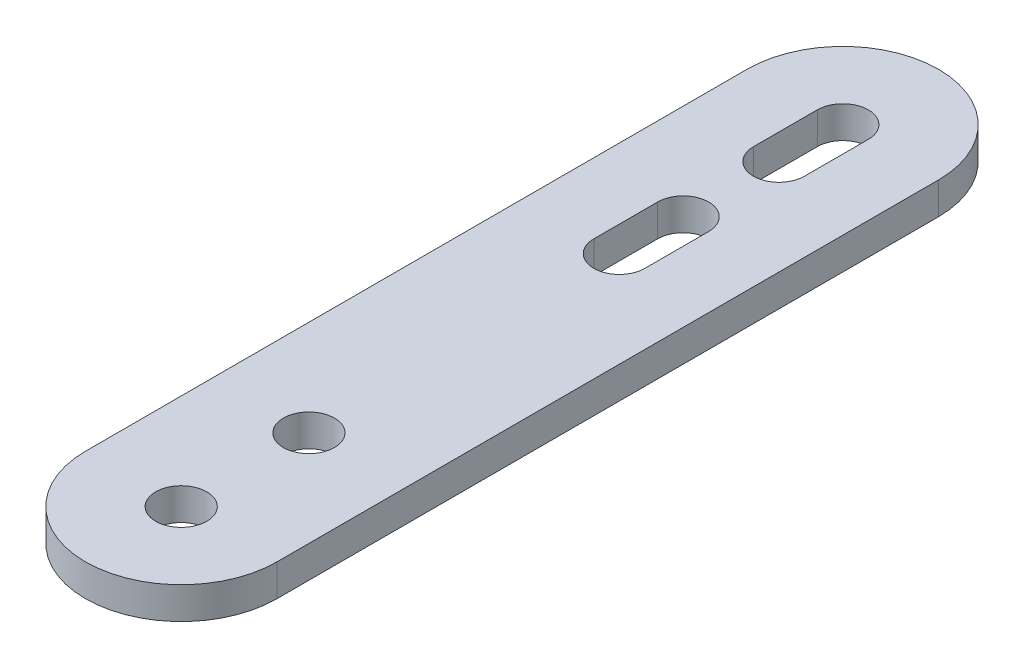
ISO-10303-21;
HEADER;
FILE_DESCRIPTION(('STEP AP214'),'2;1');
FILE_NAME('part.step','',(''),(''),'','','');
FILE_SCHEMA(('AUTOMOTIVE_DESIGN { 1 0 10303 214 1 1 1 1 }'));
ENDSEC;
DATA;
#1=APPLICATION_CONTEXT('core data for automotive mechanical design processes');
#2=APPLICATION_PROTOCOL_DEFINITION('international standard','automotive_design',2000,#1);
#3=PRODUCT_CONTEXT('',#1,'mechanical');
#4=PRODUCT('Part','Part','',(#3));
#5=PRODUCT_RELATED_PRODUCT_CATEGORY('part','',(#4));
#6=PRODUCT_DEFINITION_FORMATION('','',#4);
#7=PRODUCT_DEFINITION_CONTEXT('part definition',#1,'design');
#8=PRODUCT_DEFINITION('design','',#6,#7);
#9=PRODUCT_DEFINITION_SHAPE('','',#8);
#10=(LENGTH_UNIT() NAMED_UNIT(*) SI_UNIT(.MILLI.,.METRE.));
#11=(NAMED_UNIT(*) PLANE_ANGLE_UNIT() SI_UNIT($,.RADIAN.));
#12=(NAMED_UNIT(*) SI_UNIT($,.STERADIAN.) SOLID_ANGLE_UNIT());
#13=UNCERTAINTY_MEASURE_WITH_UNIT(LENGTH_MEASURE(1.E-05),#10,'distance_accuracy_value','');
#14=(GEOMETRIC_REPRESENTATION_CONTEXT(3) GLOBAL_UNCERTAINTY_ASSIGNED_CONTEXT((#13)) GLOBAL_UNIT_ASSIGNED_CONTEXT((#10,
#11,#12)) REPRESENTATION_CONTEXT('',''));
#15=CARTESIAN_POINT('',(0.,0.,0.));
#16=DIRECTION('',(0.,0.,1.));
#17=DIRECTION('',(1.,0.,0.));
#18=AXIS2_PLACEMENT_3D('',#15,#16,#17);
#19=CARTESIAN_POINT('',(0.,0.,-38.6108393913044));
#20=DIRECTION('',(0.,1.,0.));
#21=DIRECTION('',(1.,0.,0.));
#22=AXIS2_PLACEMENT_3D('',#19,#20,#21);
#23=CYLINDRICAL_SURFACE('',#22,4.00000000000002);
#24=CARTESIAN_POINT('',(0.,5.00000000000002,-38.6108393913044));
#25=DIRECTION('',(0.,1.,0.));
#26=DIRECTION('',(1.,0.,0.));
#27=AXIS2_PLACEMENT_3D('',#24,#25,#26);
#28=CIRCLE('',#27,4.00000000000002);
#29=CARTESIAN_POINT('',(-4.00000000000001,5.00000000000002,-38.6108393913044));
#30=VERTEX_POINT('',#29);
#31=CARTESIAN_POINT('',(4.00000000000002,5.00000000000002,-38.6108393913044));
#32=VERTEX_POINT('',#31);
#33=EDGE_CURVE('E181',#30,#32,#28,.T.);
#34=ORIENTED_EDGE('',*,*,#33,.T.);
#35=DIRECTION('',(0.,1.,0.));
#36=VECTOR('',#35,1.);
#37=CARTESIAN_POINT('',(4.00000000000002,0.,-38.6108393913044));
#38=LINE('',#37,#36);
#39=CARTESIAN_POINT('',(4.00000000000002,0.,-38.6108393913044));
#40=VERTEX_POINT('',#39);
#41=EDGE_CURVE('E228',#40,#32,#38,.T.);
#42=ORIENTED_EDGE('',*,*,#41,.F.);
#43=CARTESIAN_POINT('',(0.,0.,-38.6108393913044));
#44=DIRECTION('',(0.,1.,0.));
#45=DIRECTION('',(1.,0.,0.));
#46=AXIS2_PLACEMENT_3D('',#43,#44,#45);
#47=CIRCLE('',#46,4.00000000000002);
#48=CARTESIAN_POINT('',(-4.00000000000001,0.,-38.6108393913044));
#49=VERTEX_POINT('',#48);
#50=EDGE_CURVE('E140',#49,#40,#47,.T.);
#51=ORIENTED_EDGE('',*,*,#50,.F.);
#52=DIRECTION('',(0.,1.,0.));
#53=VECTOR('',#52,1.);
#54=CARTESIAN_POINT('',(-4.00000000000001,0.,-38.6108393913044));
#55=LINE('',#54,#53);
#56=EDGE_CURVE('E234',#49,#30,#55,.T.);
#57=ORIENTED_EDGE('',*,*,#56,.T.);
#58=EDGE_LOOP('',(#34,#42,#51,#57));
#59=FACE_BOUND('',#58,.T.);
#60=ADVANCED_FACE('F45',(#59),#23,.F.);
#61=CARTESIAN_POINT('',(-4.00000000000001,0.,-48.6108393913044));
#62=DIRECTION('',(-1.,0.,0.));
#63=DIRECTION('',(0.,0.,1.));
#64=AXIS2_PLACEMENT_3D('',#61,#62,#63);
#65=PLANE('',#64);
#66=DIRECTION('',(0.,0.,1.));
#67=VECTOR('',#66,1.);
#68=CARTESIAN_POINT('',(-4.00000000000001,5.00000000000002,-48.6108393913044));
#69=LINE('',#68,#67);
#70=CARTESIAN_POINT('',(-4.00000000000001,5.00000000000002,-48.6108393913044));
#71=VERTEX_POINT('',#70);
#72=EDGE_CURVE('E184',#71,#30,#69,.T.);
#73=ORIENTED_EDGE('',*,*,#72,.T.);
#74=ORIENTED_EDGE('',*,*,#56,.F.);
#75=DIRECTION('',(0.,0.,1.));
#76=VECTOR('',#75,1.);
#77=CARTESIAN_POINT('',(-4.00000000000001,0.,-48.6108393913044));
#78=LINE('',#77,#76);
#79=CARTESIAN_POINT('',(-4.00000000000001,0.,-48.6108393913044));
#80=VERTEX_POINT('',#79);
#81=EDGE_CURVE('E219',#80,#49,#78,.T.);
#82=ORIENTED_EDGE('',*,*,#81,.F.);
#83=DIRECTION('',(0.,1.,0.));
#84=VECTOR('',#83,1.);
#85=CARTESIAN_POINT('',(-4.00000000000001,0.,-48.6108393913044));
#86=LINE('',#85,#84);
#87=EDGE_CURVE('E231',#80,#71,#86,.T.);
#88=ORIENTED_EDGE('',*,*,#87,.T.);
#89=EDGE_LOOP('',(#73,#74,#82,#88));
#90=FACE_BOUND('',#89,.T.);
#91=ADVANCED_FACE('F242',(#90),#65,.F.);
#92=CARTESIAN_POINT('',(0.,0.,-48.6108393913044));
#93=DIRECTION('',(0.,1.,0.));
#94=DIRECTION('',(1.,0.,0.));
#95=AXIS2_PLACEMENT_3D('',#92,#93,#94);
#96=CYLINDRICAL_SURFACE('',#95,4.00000000000002);
#97=CARTESIAN_POINT('',(0.,5.00000000000002,-48.6108393913044));
#98=DIRECTION('',(0.,1.,0.));
#99=DIRECTION('',(1.,0.,0.));
#100=AXIS2_PLACEMENT_3D('',#97,#98,#99);
#101=CIRCLE('',#100,4.00000000000002);
#102=CARTESIAN_POINT('',(4.00000000000002,5.00000000000002,-48.6108393913044));
#103=VERTEX_POINT('',#102);
#104=EDGE_CURVE('E176',#103,#71,#101,.T.);
#105=ORIENTED_EDGE('',*,*,#104,.T.);
#106=ORIENTED_EDGE('',*,*,#87,.F.);
#107=CARTESIAN_POINT('',(0.,0.,-48.6108393913044));
#108=DIRECTION('',(0.,1.,0.));
#109=DIRECTION('',(1.,0.,0.));
#110=AXIS2_PLACEMENT_3D('',#107,#108,#109);
#111=CIRCLE('',#110,4.00000000000002);
#112=CARTESIAN_POINT('',(4.00000000000002,0.,-48.6108393913044));
#113=VERTEX_POINT('',#112);
#114=EDGE_CURVE('E217',#113,#80,#111,.T.);
#115=ORIENTED_EDGE('',*,*,#114,.F.);
#116=DIRECTION('',(0.,1.,0.));
#117=VECTOR('',#116,1.);
#118=CARTESIAN_POINT('',(4.00000000000002,0.,-48.6108393913044));
#119=LINE('',#118,#117);
#120=EDGE_CURVE('E225',#113,#103,#119,.T.);
#121=ORIENTED_EDGE('',*,*,#120,.T.);
#122=EDGE_LOOP('',(#105,#106,#115,#121));
#123=FACE_BOUND('',#122,.T.);
#124=ADVANCED_FACE('F252',(#123),#96,.F.);
#125=CARTESIAN_POINT('',(4.00000000000002,0.,-48.6108393913044));
#126=DIRECTION('',(1.,0.,0.));
#127=DIRECTION('',(0.,0.,-1.));
#128=AXIS2_PLACEMENT_3D('',#125,#126,#127);
#129=PLANE('',#128);
#130=DIRECTION('',(0.,0.,-1.));
#131=VECTOR('',#130,1.);
#132=CARTESIAN_POINT('',(4.00000000000002,5.00000000000002,-48.6108393913044));
#133=LINE('',#132,#131);
#134=EDGE_CURVE('E178',#32,#103,#133,.T.);
#135=ORIENTED_EDGE('',*,*,#134,.T.);
#136=ORIENTED_EDGE('',*,*,#120,.F.);
#137=DIRECTION('',(0.,0.,-1.));
#138=VECTOR('',#137,1.);
#139=CARTESIAN_POINT('',(4.00000000000002,0.,-48.6108393913044));
#140=LINE('',#139,#138);
#141=EDGE_CURVE('E215',#40,#113,#140,.T.);
#142=ORIENTED_EDGE('',*,*,#141,.F.);
#143=ORIENTED_EDGE('',*,*,#41,.T.);
#144=EDGE_LOOP('',(#135,#136,#142,#143));
#145=FACE_BOUND('',#144,.T.);
#146=ADVANCED_FACE('F249',(#145),#129,.F.);
#147=CARTESIAN_POINT('',(-15.,0.,-63.6108393913044));
#148=DIRECTION('',(0.,1.,0.));
#149=DIRECTION('',(1.,0.,0.));
#150=AXIS2_PLACEMENT_3D('',#147,#148,#149);
#151=PLANE('',#150);
#152=DIRECTION('',(0.,0.,1.));
#153=VECTOR('',#152,1.);
#154=CARTESIAN_POINT('',(-4.,0.,-13.6108393913044));
#155=LINE('',#154,#153);
#156=CARTESIAN_POINT('',(-4.,0.,-23.6108393913044));
#157=VERTEX_POINT('',#156);
#158=CARTESIAN_POINT('',(-4.,0.,-13.6108393913044));
#159=VERTEX_POINT('',#158);
#160=EDGE_CURVE('E212',#157,#159,#155,.T.);
#161=ORIENTED_EDGE('',*,*,#160,.T.);
#162=CARTESIAN_POINT('',(0.,0.,-13.6108393913044));
#163=DIRECTION('',(0.,1.,0.));
#164=DIRECTION('',(1.,0.,0.));
#165=AXIS2_PLACEMENT_3D('',#162,#163,#164);
#166=CIRCLE('',#165,4.);
#167=CARTESIAN_POINT('',(4.00000000000001,0.,-13.6108393913044));
#168=VERTEX_POINT('',#167);
#169=EDGE_CURVE('E194',#159,#168,#166,.T.);
#170=ORIENTED_EDGE('',*,*,#169,.T.);
#171=DIRECTION('',(0.,0.,-1.));
#172=VECTOR('',#171,1.);
#173=CARTESIAN_POINT('',(4.00000000000001,0.,-13.6108393913044));
#174=LINE('',#173,#172);
#175=CARTESIAN_POINT('',(4.00000000000001,0.,-23.6108393913044));
#176=VERTEX_POINT('',#175);
#177=EDGE_CURVE('E203',#168,#176,#174,.T.);
#178=ORIENTED_EDGE('',*,*,#177,.T.);
#179=CARTESIAN_POINT('',(0.,0.,-23.6108393913044));
#180=DIRECTION('',(0.,1.,0.));
#181=DIRECTION('',(1.,0.,0.));
#182=AXIS2_PLACEMENT_3D('',#179,#180,#181);
#183=CIRCLE('',#182,4.);
#184=EDGE_CURVE('E209',#176,#157,#183,.T.);
#185=ORIENTED_EDGE('',*,*,#184,.T.);
#186=EDGE_LOOP('',(#161,#170,#178,#185));
#187=FACE_BOUND('',#186,.T.);
#188=ORIENTED_EDGE('',*,*,#141,.T.);
#189=ORIENTED_EDGE('',*,*,#114,.T.);
#190=ORIENTED_EDGE('',*,*,#81,.T.);
#191=ORIENTED_EDGE('',*,*,#50,.T.);
#192=EDGE_LOOP('',(#188,#189,#190,#191));
#193=FACE_BOUND('',#192,.T.);
#194=DIRECTION('',(0.,0.,1.));
#195=VECTOR('',#194,1.);
#196=CARTESIAN_POINT('',(15.,0.,-63.6108393913044));
#197=LINE('',#196,#195);
#198=CARTESIAN_POINT('',(15.,0.,-48.6108393913044));
#199=VERTEX_POINT('',#198);
#200=CARTESIAN_POINT('',(15.,0.,55.));
#201=VERTEX_POINT('',#200);
#202=EDGE_CURVE('E147',#199,#201,#197,.T.);
#203=ORIENTED_EDGE('',*,*,#202,.T.);
#204=CARTESIAN_POINT('',(0.,0.,55.));
#205=DIRECTION('',(0.,1.,0.));
#206=DIRECTION('',(0.,0.,1.));
#207=AXIS2_PLACEMENT_3D('',#204,#205,#206);
#208=CIRCLE('',#207,15.);
#209=CARTESIAN_POINT('',(-15.,0.,55.));
#210=VERTEX_POINT('',#209);
#211=EDGE_CURVE('E143',#201,#210,#208,.F.);
#212=ORIENTED_EDGE('',*,*,#211,.T.);
#213=DIRECTION('',(0.,0.,1.));
#214=VECTOR('',#213,1.);
#215=CARTESIAN_POINT('',(-15.,0.,-63.6108393913044));
#216=LINE('',#215,#214);
#217=CARTESIAN_POINT('',(-15.,0.,-48.6108393913044));
#218=VERTEX_POINT('',#217);
#219=EDGE_CURVE('E132',#218,#210,#216,.T.);
#220=ORIENTED_EDGE('',*,*,#219,.F.);
#221=CARTESIAN_POINT('',(0.,0.,-48.6108393913044));
#222=DIRECTION('',(0.,1.,0.));
#223=DIRECTION('',(1.,0.,0.));
#224=AXIS2_PLACEMENT_3D('',#221,#222,#223);
#225=CIRCLE('',#224,15.);
#226=EDGE_CURVE('E139',#218,#199,#225,.F.);
#227=ORIENTED_EDGE('',*,*,#226,.T.);
#228=EDGE_LOOP('',(#203,#212,#220,#227));
#229=FACE_BOUND('',#228,.T.);
#230=CARTESIAN_POINT('',(0.,0.,55.));
#231=DIRECTION('',(0.,1.,0.));
#232=DIRECTION('',(0.,0.,1.));
#233=AXIS2_PLACEMENT_3D('',#230,#231,#232);
#234=CIRCLE('',#233,4.);
#235=CARTESIAN_POINT('',(0.,0.,59.));
#236=VERTEX_POINT('',#235);
#237=EDGE_CURVE('E292',#236,#236,#234,.T.);
#238=ORIENTED_EDGE('',*,*,#237,.T.);
#239=EDGE_LOOP('',(#238));
#240=FACE_BOUND('',#239,.T.);
#241=CARTESIAN_POINT('',(0.,0.,35.));
#242=DIRECTION('',(0.,1.,0.));
#243=DIRECTION('',(0.,0.,1.));
#244=AXIS2_PLACEMENT_3D('',#241,#242,#243);
#245=CIRCLE('',#244,4.);
#246=CARTESIAN_POINT('',(0.,0.,39.));
#247=VERTEX_POINT('',#246);
#248=EDGE_CURVE('E152',#247,#247,#245,.T.);
#249=ORIENTED_EDGE('',*,*,#248,.T.);
#250=EDGE_LOOP('',(#249));
#251=FACE_BOUND('',#250,.T.);
#252=ADVANCED_FACE('F144',(#187,#193,#229,#240,#251),#151,.F.);
#253=CARTESIAN_POINT('',(-4.,0.,-13.6108393913044));
#254=DIRECTION('',(-1.,0.,0.));
#255=DIRECTION('',(0.,0.,1.));
#256=AXIS2_PLACEMENT_3D('',#253,#254,#255);
#257=PLANE('',#256);
#258=DIRECTION('',(0.,0.,1.));
#259=VECTOR('',#258,1.);
#260=CARTESIAN_POINT('',(-4.,5.00000000000001,-13.6108393913044));
#261=LINE('',#260,#259);
#262=CARTESIAN_POINT('',(-4.,5.00000000000001,-23.6108393913044));
#263=VERTEX_POINT('',#262);
#264=CARTESIAN_POINT('',(-4.,5.00000000000001,-13.6108393913044));
#265=VERTEX_POINT('',#264);
#266=EDGE_CURVE('E167',#263,#265,#261,.T.);
#267=ORIENTED_EDGE('',*,*,#266,.T.);
#268=DIRECTION('',(0.,1.,0.));
#269=VECTOR('',#268,1.);
#270=CARTESIAN_POINT('',(-4.,0.,-13.6108393913044));
#271=LINE('',#270,#269);
#272=EDGE_CURVE('E197',#159,#265,#271,.T.);
#273=ORIENTED_EDGE('',*,*,#272,.F.);
#274=ORIENTED_EDGE('',*,*,#160,.F.);
#275=DIRECTION('',(0.,1.,0.));
#276=VECTOR('',#275,1.);
#277=CARTESIAN_POINT('',(-4.,0.,-23.6108393913044));
#278=LINE('',#277,#276);
#279=EDGE_CURVE('E206',#157,#263,#278,.T.);
#280=ORIENTED_EDGE('',*,*,#279,.T.);
#281=EDGE_LOOP('',(#267,#273,#274,#280));
#282=FACE_BOUND('',#281,.T.);
#283=ADVANCED_FACE('F255',(#282),#257,.F.);
#284=CARTESIAN_POINT('',(0.,0.,-23.6108393913044));
#285=DIRECTION('',(0.,1.,0.));
#286=DIRECTION('',(1.,0.,0.));
#287=AXIS2_PLACEMENT_3D('',#284,#285,#286);
#288=CYLINDRICAL_SURFACE('',#287,4.);
#289=CARTESIAN_POINT('',(0.,5.00000000000001,-23.6108393913044));
#290=DIRECTION('',(0.,1.,0.));
#291=DIRECTION('',(1.,0.,0.));
#292=AXIS2_PLACEMENT_3D('',#289,#290,#291);
#293=CIRCLE('',#292,4.);
#294=CARTESIAN_POINT('',(4.,5.00000000000001,-23.6108393913044));
#295=VERTEX_POINT('',#294);
#296=EDGE_CURVE('E170',#295,#263,#293,.T.);
#297=ORIENTED_EDGE('',*,*,#296,.T.);
#298=ORIENTED_EDGE('',*,*,#279,.F.);
#299=ORIENTED_EDGE('',*,*,#184,.F.);
#300=DIRECTION('',(0.,1.,0.));
#301=VECTOR('',#300,1.);
#302=CARTESIAN_POINT('',(4.,0.,-23.6108393913044));
#303=LINE('',#302,#301);
#304=EDGE_CURVE('E200',#176,#295,#303,.T.);
#305=ORIENTED_EDGE('',*,*,#304,.T.);
#306=EDGE_LOOP('',(#297,#298,#299,#305));
#307=FACE_BOUND('',#306,.T.);
#308=ADVANCED_FACE('F262',(#307),#288,.F.);
#309=CARTESIAN_POINT('',(4.00000000000001,0.,-13.6108393913044));
#310=DIRECTION('',(1.,0.,0.));
#311=DIRECTION('',(0.,0.,-1.));
#312=AXIS2_PLACEMENT_3D('',#309,#310,#311);
#313=PLANE('',#312);
#314=DIRECTION('',(0.,0.,-1.));
#315=VECTOR('',#314,1.);
#316=CARTESIAN_POINT('',(4.00000000000001,5.00000000000001,-13.6108393913044));
#317=LINE('',#316,#315);
#318=CARTESIAN_POINT('',(4.00000000000001,5.00000000000001,-13.6108393913044));
#319=VERTEX_POINT('',#318);
#320=EDGE_CURVE('E173',#319,#295,#317,.T.);
#321=ORIENTED_EDGE('',*,*,#320,.T.);
#322=ORIENTED_EDGE('',*,*,#304,.F.);
#323=ORIENTED_EDGE('',*,*,#177,.F.);
#324=DIRECTION('',(0.,1.,0.));
#325=VECTOR('',#324,1.);
#326=CARTESIAN_POINT('',(4.00000000000001,0.,-13.6108393913044));
#327=LINE('',#326,#325);
#328=EDGE_CURVE('E191',#168,#319,#327,.T.);
#329=ORIENTED_EDGE('',*,*,#328,.T.);
#330=EDGE_LOOP('',(#321,#322,#323,#329));
#331=FACE_BOUND('',#330,.T.);
#332=ADVANCED_FACE('F317',(#331),#313,.F.);
#333=CARTESIAN_POINT('',(0.,0.,-13.6108393913044));
#334=DIRECTION('',(0.,1.,0.));
#335=DIRECTION('',(1.,0.,0.));
#336=AXIS2_PLACEMENT_3D('',#333,#334,#335);
#337=CYLINDRICAL_SURFACE('',#336,4.);
#338=CARTESIAN_POINT('',(0.,5.00000000000001,-13.6108393913044));
#339=DIRECTION('',(0.,1.,0.));
#340=DIRECTION('',(1.,0.,0.));
#341=AXIS2_PLACEMENT_3D('',#338,#339,#340);
#342=CIRCLE('',#341,4.);
#343=EDGE_CURVE('E165',#265,#319,#342,.T.);
#344=ORIENTED_EDGE('',*,*,#343,.T.);
#345=ORIENTED_EDGE('',*,*,#328,.F.);
#346=ORIENTED_EDGE('',*,*,#169,.F.);
#347=ORIENTED_EDGE('',*,*,#272,.T.);
#348=EDGE_LOOP('',(#344,#345,#346,#347));
#349=FACE_BOUND('',#348,.T.);
#350=ADVANCED_FACE('F284',(#349),#337,.F.);
#351=CARTESIAN_POINT('',(-15.,5.00000000000001,0.));
#352=DIRECTION('',(0.,1.,0.));
#353=DIRECTION('',(0.,0.,1.));
#354=AXIS2_PLACEMENT_3D('',#351,#352,#353);
#355=PLANE('',#354);
#356=DIRECTION('',(0.,0.,-1.));
#357=VECTOR('',#356,1.);
#358=CARTESIAN_POINT('',(-15.,5.00000000000002,-63.6108393913044));
#359=LINE('',#358,#357);
#360=CARTESIAN_POINT('',(-15.,5.00000000000003,-48.6108393913044));
#361=VERTEX_POINT('',#360);
#362=CARTESIAN_POINT('',(-15.,5.,55.));
#363=VERTEX_POINT('',#362);
#364=EDGE_CURVE('E67',#361,#363,#359,.F.);
#365=ORIENTED_EDGE('',*,*,#364,.T.);
#366=CARTESIAN_POINT('',(0.,5.,55.));
#367=DIRECTION('',(0.,1.,0.));
#368=DIRECTION('',(0.,0.,1.));
#369=AXIS2_PLACEMENT_3D('',#366,#367,#368);
#370=CIRCLE('',#369,15.);
#371=CARTESIAN_POINT('',(15.,5.,55.));
#372=VERTEX_POINT('',#371);
#373=EDGE_CURVE('E157',#363,#372,#370,.T.);
#374=ORIENTED_EDGE('',*,*,#373,.T.);
#375=DIRECTION('',(0.,0.,-1.));
#376=VECTOR('',#375,1.);
#377=CARTESIAN_POINT('',(15.,5.00000000000002,-63.6108393913044));
#378=LINE('',#377,#376);
#379=CARTESIAN_POINT('',(15.,5.00000000000003,-48.6108393913044));
#380=VERTEX_POINT('',#379);
#381=EDGE_CURVE('E187',#380,#372,#378,.F.);
#382=ORIENTED_EDGE('',*,*,#381,.F.);
#383=CARTESIAN_POINT('',(0.,5.00000000000002,-48.6108393913044));
#384=DIRECTION('',(0.,1.,0.));
#385=DIRECTION('',(1.,0.,0.));
#386=AXIS2_PLACEMENT_3D('',#383,#384,#385);
#387=CIRCLE('',#386,15.);
#388=EDGE_CURVE('E59',#380,#361,#387,.T.);
#389=ORIENTED_EDGE('',*,*,#388,.T.);
#390=EDGE_LOOP('',(#365,#374,#382,#389));
#391=FACE_BOUND('',#390,.T.);
#392=ORIENTED_EDGE('',*,*,#343,.F.);
#393=ORIENTED_EDGE('',*,*,#266,.F.);
#394=ORIENTED_EDGE('',*,*,#296,.F.);
#395=ORIENTED_EDGE('',*,*,#320,.F.);
#396=EDGE_LOOP('',(#392,#393,#394,#395));
#397=FACE_BOUND('',#396,.T.);
#398=ORIENTED_EDGE('',*,*,#104,.F.);
#399=ORIENTED_EDGE('',*,*,#134,.F.);
#400=ORIENTED_EDGE('',*,*,#33,.F.);
#401=ORIENTED_EDGE('',*,*,#72,.F.);
#402=EDGE_LOOP('',(#398,#399,#400,#401));
#403=FACE_BOUND('',#402,.T.);
#404=CARTESIAN_POINT('',(0.,5.,35.));
#405=DIRECTION('',(0.,1.,0.));
#406=DIRECTION('',(0.,0.,1.));
#407=AXIS2_PLACEMENT_3D('',#404,#405,#406);
#408=CIRCLE('',#407,4.);
#409=CARTESIAN_POINT('',(0.,5.,39.));
#410=VERTEX_POINT('',#409);
#411=EDGE_CURVE('E161',#410,#410,#408,.T.);
#412=ORIENTED_EDGE('',*,*,#411,.F.);
#413=EDGE_LOOP('',(#412));
#414=FACE_BOUND('',#413,.T.);
#415=CARTESIAN_POINT('',(0.,5.,55.));
#416=DIRECTION('',(0.,1.,0.));
#417=DIRECTION('',(0.,0.,1.));
#418=AXIS2_PLACEMENT_3D('',#415,#416,#417);
#419=CIRCLE('',#418,4.);
#420=CARTESIAN_POINT('',(0.,5.,59.));
#421=VERTEX_POINT('',#420);
#422=EDGE_CURVE('E158',#421,#421,#419,.T.);
#423=ORIENTED_EDGE('',*,*,#422,.F.);
#424=EDGE_LOOP('',(#423));
#425=FACE_BOUND('',#424,.T.);
#426=ADVANCED_FACE('F47',(#391,#397,#403,#414,#425),#355,.T.);
#427=CARTESIAN_POINT('',(15.,146.841948372969,-63.6108393913043));
#428=DIRECTION('',(1.,0.,0.));
#429=DIRECTION('',(0.,0.,-1.));
#430=AXIS2_PLACEMENT_3D('',#427,#428,#429);
#431=PLANE('',#430);
#432=ORIENTED_EDGE('',*,*,#202,.F.);
#433=DIRECTION('',(0.,-1.,0.));
#434=VECTOR('',#433,1.);
#435=CARTESIAN_POINT('',(15.,146.841948372969,-48.6108393913043));
#436=LINE('',#435,#434);
#437=EDGE_CURVE('E12',#380,#199,#436,.T.);
#438=ORIENTED_EDGE('',*,*,#437,.F.);
#439=ORIENTED_EDGE('',*,*,#381,.T.);
#440=DIRECTION('',(0.,-1.,0.));
#441=VECTOR('',#440,1.);
#442=CARTESIAN_POINT('',(15.,146.841948372969,55.));
#443=LINE('',#442,#441);
#444=EDGE_CURVE('E151',#372,#201,#443,.T.);
#445=ORIENTED_EDGE('',*,*,#444,.T.);
#446=EDGE_LOOP('',(#432,#438,#439,#445));
#447=FACE_BOUND('',#446,.T.);
#448=ADVANCED_FACE('F278',(#447),#431,.T.);
#449=CARTESIAN_POINT('',(0.,146.841948372969,-48.6108393913043));
#450=DIRECTION('',(0.,-1.,0.));
#451=DIRECTION('',(0.,0.,-1.));
#452=AXIS2_PLACEMENT_3D('',#449,#450,#451);
#453=CYLINDRICAL_SURFACE('',#452,15.);
#454=ORIENTED_EDGE('',*,*,#437,.T.);
#455=ORIENTED_EDGE('',*,*,#226,.F.);
#456=DIRECTION('',(0.,-1.,0.));
#457=VECTOR('',#456,1.);
#458=CARTESIAN_POINT('',(-15.,146.841948372969,-48.6108393913043));
#459=LINE('',#458,#457);
#460=EDGE_CURVE('E53',#361,#218,#459,.T.);
#461=ORIENTED_EDGE('',*,*,#460,.F.);
#462=ORIENTED_EDGE('',*,*,#388,.F.);
#463=EDGE_LOOP('',(#454,#455,#461,#462));
#464=FACE_BOUND('',#463,.T.);
#465=ADVANCED_FACE('F276',(#464),#453,.T.);
#466=CARTESIAN_POINT('',(-15.,146.841948372969,-63.6108393913043));
#467=DIRECTION('',(1.,0.,0.));
#468=DIRECTION('',(0.,0.,-1.));
#469=AXIS2_PLACEMENT_3D('',#466,#467,#468);
#470=PLANE('',#469);
#471=ORIENTED_EDGE('',*,*,#460,.T.);
#472=ORIENTED_EDGE('',*,*,#219,.T.);
#473=DIRECTION('',(0.,-1.,0.));
#474=VECTOR('',#473,1.);
#475=CARTESIAN_POINT('',(-15.,146.841948372969,55.));
#476=LINE('',#475,#474);
#477=EDGE_CURVE('E136',#363,#210,#476,.T.);
#478=ORIENTED_EDGE('',*,*,#477,.F.);
#479=ORIENTED_EDGE('',*,*,#364,.F.);
#480=EDGE_LOOP('',(#471,#472,#478,#479));
#481=FACE_BOUND('',#480,.T.);
#482=ADVANCED_FACE('F134',(#481),#470,.F.);
#483=CARTESIAN_POINT('',(0.,146.841948372969,55.));
#484=DIRECTION('',(0.,-1.,0.));
#485=DIRECTION('',(0.,0.,-1.));
#486=AXIS2_PLACEMENT_3D('',#483,#484,#485);
#487=CYLINDRICAL_SURFACE('',#486,15.);
#488=ORIENTED_EDGE('',*,*,#477,.T.);
#489=ORIENTED_EDGE('',*,*,#211,.F.);
#490=ORIENTED_EDGE('',*,*,#444,.F.);
#491=ORIENTED_EDGE('',*,*,#373,.F.);
#492=EDGE_LOOP('',(#488,#489,#490,#491));
#493=FACE_BOUND('',#492,.T.);
#494=ADVANCED_FACE('F155',(#493),#487,.T.);
#495=CARTESIAN_POINT('',(0.,0.,55.));
#496=DIRECTION('',(0.,1.,0.));
#497=DIRECTION('',(0.,0.,1.));
#498=AXIS2_PLACEMENT_3D('',#495,#496,#497);
#499=CYLINDRICAL_SURFACE('',#498,4.);
#500=ORIENTED_EDGE('',*,*,#237,.F.);
#501=EDGE_LOOP('',(#500));
#502=FACE_BOUND('',#501,.T.);
#503=ORIENTED_EDGE('',*,*,#422,.T.);
#504=EDGE_LOOP('',(#503));
#505=FACE_BOUND('',#504,.T.);
#506=ADVANCED_FACE('F302',(#502,#505),#499,.F.);
#507=CARTESIAN_POINT('',(0.,0.,35.));
#508=DIRECTION('',(0.,1.,0.));
#509=DIRECTION('',(0.,0.,1.));
#510=AXIS2_PLACEMENT_3D('',#507,#508,#509);
#511=CYLINDRICAL_SURFACE('',#510,4.);
#512=ORIENTED_EDGE('',*,*,#248,.F.);
#513=EDGE_LOOP('',(#512));
#514=FACE_BOUND('',#513,.T.);
#515=ORIENTED_EDGE('',*,*,#411,.T.);
#516=EDGE_LOOP('',(#515));
#517=FACE_BOUND('',#516,.T.);
#518=ADVANCED_FACE('F298',(#514,#517),#511,.F.);
#519=CLOSED_SHELL('',(#60,#91,#124,#146,#252,#283,#308,#332,#350,#426,#448,#465,#482,#494,#506,#518));
#520=MANIFOLD_SOLID_BREP('B2',#519);
#521=ADVANCED_BREP_SHAPE_REPRESENTATION('',(#18,#520),#14);
#522=SHAPE_DEFINITION_REPRESENTATION(#9,#521);
ENDSEC;
END-ISO-10303-21;
